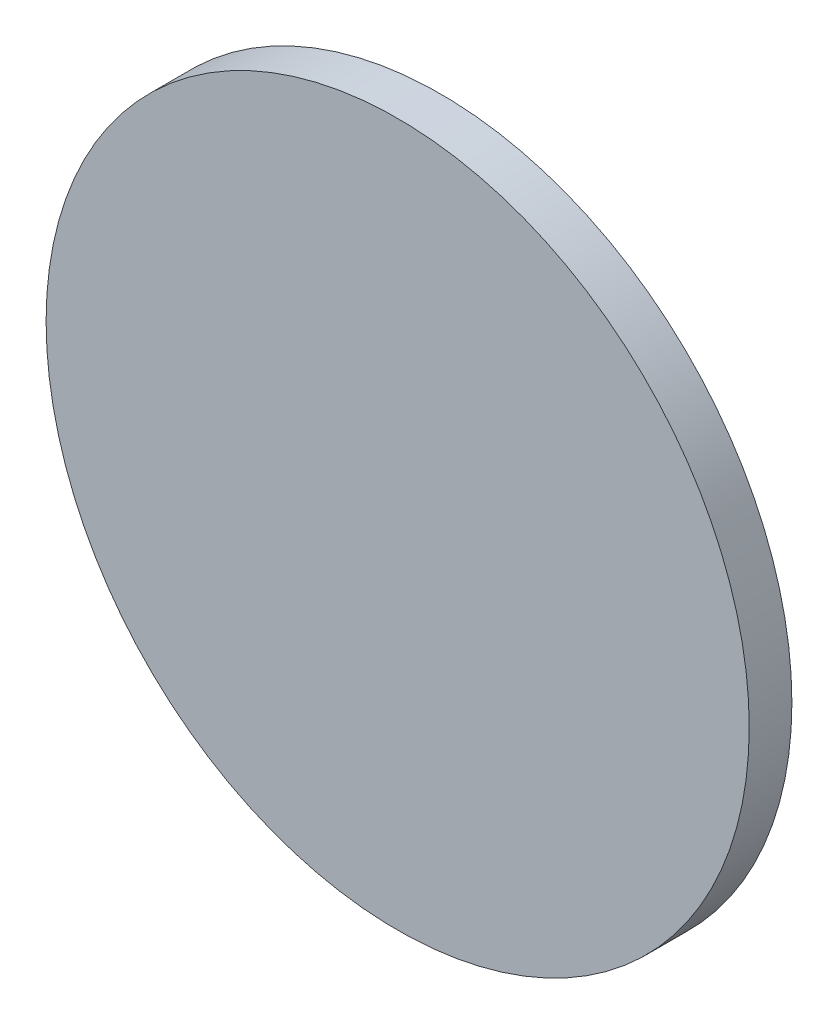
ISO-10303-21;
HEADER;
FILE_DESCRIPTION(('STEP AP214'),'2;1');
FILE_NAME('part.step','',(''),(''),'','','');
FILE_SCHEMA(('AUTOMOTIVE_DESIGN { 1 0 10303 214 1 1 1 1 }'));
ENDSEC;
DATA;
#1=APPLICATION_CONTEXT('core data for automotive mechanical design processes');
#2=APPLICATION_PROTOCOL_DEFINITION('international standard','automotive_design',2000,#1);
#3=PRODUCT_CONTEXT('',#1,'mechanical');
#4=PRODUCT('Part','Part','',(#3));
#5=PRODUCT_RELATED_PRODUCT_CATEGORY('part','',(#4));
#6=PRODUCT_DEFINITION_FORMATION('','',#4);
#7=PRODUCT_DEFINITION_CONTEXT('part definition',#1,'design');
#8=PRODUCT_DEFINITION('design','',#6,#7);
#9=PRODUCT_DEFINITION_SHAPE('','',#8);
#10=(LENGTH_UNIT() NAMED_UNIT(*) SI_UNIT(.MILLI.,.METRE.));
#11=(NAMED_UNIT(*) PLANE_ANGLE_UNIT() SI_UNIT($,.RADIAN.));
#12=(NAMED_UNIT(*) SI_UNIT($,.STERADIAN.) SOLID_ANGLE_UNIT());
#13=UNCERTAINTY_MEASURE_WITH_UNIT(LENGTH_MEASURE(1.E-05),#10,'distance_accuracy_value','');
#14=(GEOMETRIC_REPRESENTATION_CONTEXT(3) GLOBAL_UNCERTAINTY_ASSIGNED_CONTEXT((#13)) GLOBAL_UNIT_ASSIGNED_CONTEXT((#10,
#11,#12)) REPRESENTATION_CONTEXT('',''));
#15=CARTESIAN_POINT('',(0.,0.,0.));
#16=DIRECTION('',(0.,0.,1.));
#17=DIRECTION('',(1.,0.,0.));
#18=AXIS2_PLACEMENT_3D('',#15,#16,#17);
#19=CARTESIAN_POINT('',(0.,0.,9.1));
#20=DIRECTION('',(0.,0.,-1.));
#21=DIRECTION('',(-1.,0.,0.));
#22=AXIS2_PLACEMENT_3D('',#19,#20,#21);
#23=CYLINDRICAL_SURFACE('',#22,75.);
#24=CARTESIAN_POINT('',(0.,0.,9.1));
#25=DIRECTION('',(0.,0.,1.));
#26=DIRECTION('',(1.,0.,0.));
#27=AXIS2_PLACEMENT_3D('',#24,#25,#26);
#28=CIRCLE('',#27,75.);
#29=CARTESIAN_POINT('',(75.,0.,9.1));
#30=VERTEX_POINT('',#29);
#31=EDGE_CURVE('E12',#30,#30,#28,.T.);
#32=ORIENTED_EDGE('',*,*,#31,.F.);
#33=EDGE_LOOP('',(#32));
#34=FACE_BOUND('',#33,.T.);
#35=CARTESIAN_POINT('',(0.,0.,0.));
#36=DIRECTION('',(0.,0.,1.));
#37=DIRECTION('',(1.,0.,0.));
#38=AXIS2_PLACEMENT_3D('',#35,#36,#37);
#39=CIRCLE('',#38,75.);
#40=CARTESIAN_POINT('',(75.,0.,0.));
#41=VERTEX_POINT('',#40);
#42=EDGE_CURVE('E44',#41,#41,#39,.T.);
#43=ORIENTED_EDGE('',*,*,#42,.T.);
#44=EDGE_LOOP('',(#43));
#45=FACE_BOUND('',#44,.T.);
#46=ADVANCED_FACE('F41',(#34,#45),#23,.T.);
#47=CARTESIAN_POINT('',(0.,0.,9.1));
#48=DIRECTION('',(0.,0.,1.));
#49=DIRECTION('',(1.,0.,0.));
#50=AXIS2_PLACEMENT_3D('',#47,#48,#49);
#51=PLANE('',#50);
#52=ORIENTED_EDGE('',*,*,#31,.T.);
#53=EDGE_LOOP('',(#52));
#54=FACE_BOUND('',#53,.T.);
#55=ADVANCED_FACE('F56',(#54),#51,.T.);
#56=CARTESIAN_POINT('',(0.,0.,0.));
#57=DIRECTION('',(0.,0.,1.));
#58=DIRECTION('',(1.,0.,0.));
#59=AXIS2_PLACEMENT_3D('',#56,#57,#58);
#60=PLANE('',#59);
#61=ORIENTED_EDGE('',*,*,#42,.F.);
#62=EDGE_LOOP('',(#61));
#63=FACE_BOUND('',#62,.T.);
#64=ADVANCED_FACE('F54',(#63),#60,.F.);
#65=CLOSED_SHELL('',(#46,#55,#64));
#66=MANIFOLD_SOLID_BREP('B2',#65);
#67=ADVANCED_BREP_SHAPE_REPRESENTATION('',(#18,#66),#14);
#68=SHAPE_DEFINITION_REPRESENTATION(#9,#67);
ENDSEC;
END-ISO-10303-21;
